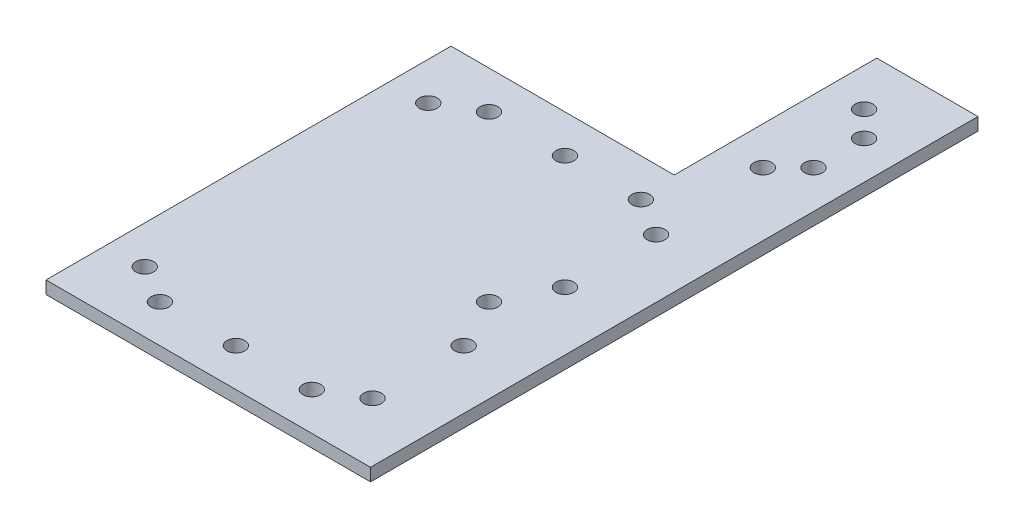
ISO-10303-21;
HEADER;
FILE_DESCRIPTION(('STEP AP214'),'2;1');
FILE_NAME('part.step','',(''),(''),'','','');
FILE_SCHEMA(('AUTOMOTIVE_DESIGN { 1 0 10303 214 1 1 1 1 }'));
ENDSEC;
DATA;
#1=APPLICATION_CONTEXT('core data for automotive mechanical design processes');
#2=APPLICATION_PROTOCOL_DEFINITION('international standard','automotive_design',2000,#1);
#3=PRODUCT_CONTEXT('',#1,'mechanical');
#4=PRODUCT('Part','Part','',(#3));
#5=PRODUCT_RELATED_PRODUCT_CATEGORY('part','',(#4));
#6=PRODUCT_DEFINITION_FORMATION('','',#4);
#7=PRODUCT_DEFINITION_CONTEXT('part definition',#1,'design');
#8=PRODUCT_DEFINITION('design','',#6,#7);
#9=PRODUCT_DEFINITION_SHAPE('','',#8);
#10=(LENGTH_UNIT() NAMED_UNIT(*) SI_UNIT(.MILLI.,.METRE.));
#11=(NAMED_UNIT(*) PLANE_ANGLE_UNIT() SI_UNIT($,.RADIAN.));
#12=(NAMED_UNIT(*) SI_UNIT($,.STERADIAN.) SOLID_ANGLE_UNIT());
#13=UNCERTAINTY_MEASURE_WITH_UNIT(LENGTH_MEASURE(1.E-05),#10,'distance_accuracy_value','');
#14=(GEOMETRIC_REPRESENTATION_CONTEXT(3) GLOBAL_UNCERTAINTY_ASSIGNED_CONTEXT((#13)) GLOBAL_UNIT_ASSIGNED_CONTEXT((#10,
#11,#12)) REPRESENTATION_CONTEXT('',''));
#15=CARTESIAN_POINT('',(0.,0.,0.));
#16=DIRECTION('',(0.,0.,1.));
#17=DIRECTION('',(1.,0.,0.));
#18=AXIS2_PLACEMENT_3D('',#15,#16,#17);
#19=CARTESIAN_POINT('',(0.,3.175,0.));
#20=DIRECTION('',(0.,-1.,0.));
#21=DIRECTION('',(0.,0.,-1.));
#22=AXIS2_PLACEMENT_3D('',#19,#20,#21);
#23=PLANE('',#22);
#24=CARTESIAN_POINT('',(27.425,3.175,-63.5));
#25=DIRECTION('',(0.,1.,0.));
#26=DIRECTION('',(0.,0.,1.));
#27=AXIS2_PLACEMENT_3D('',#24,#25,#26);
#28=CIRCLE('',#27,2.25);
#29=CARTESIAN_POINT('',(27.425,3.175,-61.25));
#30=VERTEX_POINT('',#29);
#31=EDGE_CURVE('E303',#30,#30,#28,.T.);
#32=ORIENTED_EDGE('',*,*,#31,.F.);
#33=EDGE_LOOP('',(#32));
#34=FACE_BOUND('',#33,.T.);
#35=CARTESIAN_POINT('',(27.425,3.175,-88.9));
#36=DIRECTION('',(0.,1.,0.));
#37=DIRECTION('',(0.,0.,1.));
#38=AXIS2_PLACEMENT_3D('',#35,#36,#37);
#39=CIRCLE('',#38,2.25);
#40=CARTESIAN_POINT('',(27.425,3.175,-86.65));
#41=VERTEX_POINT('',#40);
#42=EDGE_CURVE('E307',#41,#41,#39,.T.);
#43=ORIENTED_EDGE('',*,*,#42,.F.);
#44=EDGE_LOOP('',(#43));
#45=FACE_BOUND('',#44,.T.);
#46=CARTESIAN_POINT('',(33.77,3.175,-69.85));
#47=DIRECTION('',(0.,1.,0.));
#48=DIRECTION('',(0.,0.,1.));
#49=AXIS2_PLACEMENT_3D('',#46,#47,#48);
#50=CIRCLE('',#49,2.25);
#51=CARTESIAN_POINT('',(33.77,3.175,-67.6));
#52=VERTEX_POINT('',#51);
#53=EDGE_CURVE('E302',#52,#52,#50,.T.);
#54=ORIENTED_EDGE('',*,*,#53,.F.);
#55=EDGE_LOOP('',(#54));
#56=FACE_BOUND('',#55,.T.);
#57=CARTESIAN_POINT('',(33.77,3.175,-82.55));
#58=DIRECTION('',(0.,1.,0.));
#59=DIRECTION('',(0.,0.,1.));
#60=AXIS2_PLACEMENT_3D('',#57,#58,#59);
#61=CIRCLE('',#60,2.25);
#62=CARTESIAN_POINT('',(33.77,3.175,-80.3));
#63=VERTEX_POINT('',#62);
#64=EDGE_CURVE('E120',#63,#63,#61,.T.);
#65=ORIENTED_EDGE('',*,*,#64,.F.);
#66=EDGE_LOOP('',(#65));
#67=FACE_BOUND('',#66,.T.);
#68=DIRECTION('',(0.,0.,1.));
#69=VECTOR('',#68,1.);
#70=CARTESIAN_POINT('',(-38.1,3.175,-50.8));
#71=LINE('',#70,#69);
#72=CARTESIAN_POINT('',(-38.1,3.175,-50.8));
#73=VERTEX_POINT('',#72);
#74=CARTESIAN_POINT('',(-38.1,3.175,50.8));
#75=VERTEX_POINT('',#74);
#76=EDGE_CURVE('E90',#73,#75,#71,.T.);
#77=ORIENTED_EDGE('',*,*,#76,.T.);
#78=DIRECTION('',(1.,0.,0.));
#79=VECTOR('',#78,1.);
#80=CARTESIAN_POINT('',(38.1,3.175,50.8));
#81=LINE('',#80,#79);
#82=CARTESIAN_POINT('',(43.3,3.175,50.8));
#83=VERTEX_POINT('',#82);
#84=EDGE_CURVE('E270',#75,#83,#81,.T.);
#85=ORIENTED_EDGE('',*,*,#84,.T.);
#86=DIRECTION('',(0.,0.,-1.));
#87=VECTOR('',#86,1.);
#88=CARTESIAN_POINT('',(43.3,3.175,50.8));
#89=LINE('',#88,#87);
#90=CARTESIAN_POINT('',(43.3,3.175,-101.6));
#91=VERTEX_POINT('',#90);
#92=EDGE_CURVE('E130',#83,#91,#89,.T.);
#93=ORIENTED_EDGE('',*,*,#92,.T.);
#94=DIRECTION('',(-1.,0.,0.));
#95=VECTOR('',#94,1.);
#96=CARTESIAN_POINT('',(43.3,3.175,-101.6));
#97=LINE('',#96,#95);
#98=CARTESIAN_POINT('',(17.9,3.175,-101.6));
#99=VERTEX_POINT('',#98);
#100=EDGE_CURVE('E135',#91,#99,#97,.T.);
#101=ORIENTED_EDGE('',*,*,#100,.T.);
#102=DIRECTION('',(0.,0.,1.));
#103=VECTOR('',#102,1.);
#104=CARTESIAN_POINT('',(17.9,3.175,-101.6));
#105=LINE('',#104,#103);
#106=CARTESIAN_POINT('',(17.9,3.175,-50.8));
#107=VERTEX_POINT('',#106);
#108=EDGE_CURVE('E142',#99,#107,#105,.T.);
#109=ORIENTED_EDGE('',*,*,#108,.T.);
#110=DIRECTION('',(-1.,0.,0.));
#111=VECTOR('',#110,1.);
#112=CARTESIAN_POINT('',(38.1,3.175,-50.8));
#113=LINE('',#112,#111);
#114=EDGE_CURVE('E69',#107,#73,#113,.T.);
#115=ORIENTED_EDGE('',*,*,#114,.T.);
#116=EDGE_LOOP('',(#77,#85,#93,#101,#109,#115));
#117=FACE_BOUND('',#116,.T.);
#118=CARTESIAN_POINT('',(-19.05,3.175,41.275));
#119=DIRECTION('',(0.,1.,0.));
#120=DIRECTION('',(0.,0.,1.));
#121=AXIS2_PLACEMENT_3D('',#118,#119,#120);
#122=CIRCLE('',#121,2.25);
#123=CARTESIAN_POINT('',(-19.05,3.175,43.525));
#124=VERTEX_POINT('',#123);
#125=EDGE_CURVE('E104',#124,#124,#122,.T.);
#126=ORIENTED_EDGE('',*,*,#125,.F.);
#127=EDGE_LOOP('',(#126));
#128=FACE_BOUND('',#127,.T.);
#129=CARTESIAN_POINT('',(19.05,3.175,41.275));
#130=DIRECTION('',(0.,1.,0.));
#131=DIRECTION('',(0.,0.,1.));
#132=AXIS2_PLACEMENT_3D('',#129,#130,#131);
#133=CIRCLE('',#132,2.25);
#134=CARTESIAN_POINT('',(19.05,3.175,43.525));
#135=VERTEX_POINT('',#134);
#136=EDGE_CURVE('E259',#135,#135,#133,.T.);
#137=ORIENTED_EDGE('',*,*,#136,.F.);
#138=EDGE_LOOP('',(#137));
#139=FACE_BOUND('',#138,.T.);
#140=CARTESIAN_POINT('',(28.575,3.175,35.56));
#141=DIRECTION('',(0.,1.,0.));
#142=DIRECTION('',(0.,0.,1.));
#143=AXIS2_PLACEMENT_3D('',#140,#141,#142);
#144=CIRCLE('',#143,2.25);
#145=CARTESIAN_POINT('',(28.575,3.175,37.81));
#146=VERTEX_POINT('',#145);
#147=EDGE_CURVE('E251',#146,#146,#144,.T.);
#148=ORIENTED_EDGE('',*,*,#147,.F.);
#149=EDGE_LOOP('',(#148));
#150=FACE_BOUND('',#149,.T.);
#151=CARTESIAN_POINT('',(-28.575,3.175,35.56));
#152=DIRECTION('',(0.,1.,0.));
#153=DIRECTION('',(0.,0.,1.));
#154=AXIS2_PLACEMENT_3D('',#151,#152,#153);
#155=CIRCLE('',#154,2.25);
#156=CARTESIAN_POINT('',(-28.575,3.175,37.81));
#157=VERTEX_POINT('',#156);
#158=EDGE_CURVE('E243',#157,#157,#155,.T.);
#159=ORIENTED_EDGE('',*,*,#158,.F.);
#160=EDGE_LOOP('',(#159));
#161=FACE_BOUND('',#160,.T.);
#162=CARTESIAN_POINT('',(28.575,3.175,-35.56));
#163=DIRECTION('',(0.,1.,0.));
#164=DIRECTION('',(0.,0.,-1.));
#165=AXIS2_PLACEMENT_3D('',#162,#163,#164);
#166=CIRCLE('',#165,2.25);
#167=CARTESIAN_POINT('',(28.575,3.175,-37.81));
#168=VERTEX_POINT('',#167);
#169=EDGE_CURVE('E235',#168,#168,#166,.T.);
#170=ORIENTED_EDGE('',*,*,#169,.F.);
#171=EDGE_LOOP('',(#170));
#172=FACE_BOUND('',#171,.T.);
#173=CARTESIAN_POINT('',(19.05,3.175,-41.275));
#174=DIRECTION('',(0.,1.,0.));
#175=DIRECTION('',(0.,0.,-1.));
#176=AXIS2_PLACEMENT_3D('',#173,#174,#175);
#177=CIRCLE('',#176,2.25);
#178=CARTESIAN_POINT('',(19.05,3.175,-43.525));
#179=VERTEX_POINT('',#178);
#180=EDGE_CURVE('E227',#179,#179,#177,.T.);
#181=ORIENTED_EDGE('',*,*,#180,.F.);
#182=EDGE_LOOP('',(#181));
#183=FACE_BOUND('',#182,.T.);
#184=CARTESIAN_POINT('',(-28.575,3.175,-35.56));
#185=DIRECTION('',(0.,1.,0.));
#186=DIRECTION('',(0.,0.,-1.));
#187=AXIS2_PLACEMENT_3D('',#184,#185,#186);
#188=CIRCLE('',#187,2.25);
#189=CARTESIAN_POINT('',(-28.575,3.175,-37.81));
#190=VERTEX_POINT('',#189);
#191=EDGE_CURVE('E219',#190,#190,#188,.T.);
#192=ORIENTED_EDGE('',*,*,#191,.F.);
#193=EDGE_LOOP('',(#192));
#194=FACE_BOUND('',#193,.T.);
#195=CARTESIAN_POINT('',(-19.05,3.175,-41.275));
#196=DIRECTION('',(0.,1.,0.));
#197=DIRECTION('',(0.,0.,-1.));
#198=AXIS2_PLACEMENT_3D('',#195,#196,#197);
#199=CIRCLE('',#198,2.25);
#200=CARTESIAN_POINT('',(-19.05,3.175,-43.525));
#201=VERTEX_POINT('',#200);
#202=EDGE_CURVE('E211',#201,#201,#199,.T.);
#203=ORIENTED_EDGE('',*,*,#202,.F.);
#204=EDGE_LOOP('',(#203));
#205=FACE_BOUND('',#204,.T.);
#206=CARTESIAN_POINT('',(0.,3.175,41.275));
#207=DIRECTION('',(0.,1.,0.));
#208=DIRECTION('',(0.,0.,1.));
#209=AXIS2_PLACEMENT_3D('',#206,#207,#208);
#210=CIRCLE('',#209,2.25);
#211=CARTESIAN_POINT('',(0.,3.175,43.525));
#212=VERTEX_POINT('',#211);
#213=EDGE_CURVE('E203',#212,#212,#210,.T.);
#214=ORIENTED_EDGE('',*,*,#213,.F.);
#215=EDGE_LOOP('',(#214));
#216=FACE_BOUND('',#215,.T.);
#217=CARTESIAN_POINT('',(0.,3.175,-41.275));
#218=DIRECTION('',(0.,1.,0.));
#219=DIRECTION('',(0.,0.,-1.));
#220=AXIS2_PLACEMENT_3D('',#217,#218,#219);
#221=CIRCLE('',#220,2.25);
#222=CARTESIAN_POINT('',(0.,3.175,-43.525));
#223=VERTEX_POINT('',#222);
#224=EDGE_CURVE('E195',#223,#223,#221,.T.);
#225=ORIENTED_EDGE('',*,*,#224,.F.);
#226=EDGE_LOOP('',(#225));
#227=FACE_BOUND('',#226,.T.);
#228=CARTESIAN_POINT('',(28.575,3.175,-12.7));
#229=DIRECTION('',(0.,1.,0.));
#230=DIRECTION('',(0.,0.,1.));
#231=AXIS2_PLACEMENT_3D('',#228,#229,#230);
#232=CIRCLE('',#231,2.25);
#233=CARTESIAN_POINT('',(28.575,3.175,-10.45));
#234=VERTEX_POINT('',#233);
#235=EDGE_CURVE('E187',#234,#234,#232,.T.);
#236=ORIENTED_EDGE('',*,*,#235,.F.);
#237=EDGE_LOOP('',(#236));
#238=FACE_BOUND('',#237,.T.);
#239=CARTESIAN_POINT('',(28.575,3.175,12.7));
#240=DIRECTION('',(0.,1.,0.));
#241=DIRECTION('',(0.,0.,1.));
#242=AXIS2_PLACEMENT_3D('',#239,#240,#241);
#243=CIRCLE('',#242,2.25);
#244=CARTESIAN_POINT('',(28.575,3.175,14.95));
#245=VERTEX_POINT('',#244);
#246=EDGE_CURVE('E179',#245,#245,#243,.T.);
#247=ORIENTED_EDGE('',*,*,#246,.F.);
#248=EDGE_LOOP('',(#247));
#249=FACE_BOUND('',#248,.T.);
#250=CARTESIAN_POINT('',(22.23,3.175,0.));
#251=DIRECTION('',(0.,1.,0.));
#252=DIRECTION('',(0.,0.,1.));
#253=AXIS2_PLACEMENT_3D('',#250,#251,#252);
#254=CIRCLE('',#253,2.24999999999998);
#255=CARTESIAN_POINT('',(22.23,3.175,2.25));
#256=VERTEX_POINT('',#255);
#257=EDGE_CURVE('E171',#256,#256,#254,.T.);
#258=ORIENTED_EDGE('',*,*,#257,.F.);
#259=EDGE_LOOP('',(#258));
#260=FACE_BOUND('',#259,.T.);
#261=ADVANCED_FACE('F42',(#34,#45,#56,#67,#117,#128,#139,#150,#161,#172,#183,#194,#205,#216,
#227,#238,#249,#260),#23,.F.);
#262=CARTESIAN_POINT('',(0.,0.,0.));
#263=DIRECTION('',(0.,-1.,0.));
#264=DIRECTION('',(0.,0.,-1.));
#265=AXIS2_PLACEMENT_3D('',#262,#263,#264);
#266=PLANE('',#265);
#267=CARTESIAN_POINT('',(27.425,0.,-63.5));
#268=DIRECTION('',(0.,-1.,0.));
#269=DIRECTION('',(0.,0.,-1.));
#270=AXIS2_PLACEMENT_3D('',#267,#268,#269);
#271=CIRCLE('',#270,2.25);
#272=CARTESIAN_POINT('',(27.425,0.,-65.75));
#273=VERTEX_POINT('',#272);
#274=EDGE_CURVE('E46',#273,#273,#271,.T.);
#275=ORIENTED_EDGE('',*,*,#274,.F.);
#276=EDGE_LOOP('',(#275));
#277=FACE_BOUND('',#276,.T.);
#278=CARTESIAN_POINT('',(27.425,0.,-88.9));
#279=DIRECTION('',(0.,-1.,0.));
#280=DIRECTION('',(0.,0.,-1.));
#281=AXIS2_PLACEMENT_3D('',#278,#279,#280);
#282=CIRCLE('',#281,2.25);
#283=CARTESIAN_POINT('',(27.425,0.,-91.15));
#284=VERTEX_POINT('',#283);
#285=EDGE_CURVE('E123',#284,#284,#282,.T.);
#286=ORIENTED_EDGE('',*,*,#285,.F.);
#287=EDGE_LOOP('',(#286));
#288=FACE_BOUND('',#287,.T.);
#289=CARTESIAN_POINT('',(33.77,0.,-69.85));
#290=DIRECTION('',(0.,-1.,0.));
#291=DIRECTION('',(0.,0.,-1.));
#292=AXIS2_PLACEMENT_3D('',#289,#290,#291);
#293=CIRCLE('',#292,2.25);
#294=CARTESIAN_POINT('',(33.77,0.,-72.1));
#295=VERTEX_POINT('',#294);
#296=EDGE_CURVE('E119',#295,#295,#293,.T.);
#297=ORIENTED_EDGE('',*,*,#296,.F.);
#298=EDGE_LOOP('',(#297));
#299=FACE_BOUND('',#298,.T.);
#300=CARTESIAN_POINT('',(33.77,0.,-82.55));
#301=DIRECTION('',(0.,-1.,0.));
#302=DIRECTION('',(0.,0.,-1.));
#303=AXIS2_PLACEMENT_3D('',#300,#301,#302);
#304=CIRCLE('',#303,2.25);
#305=CARTESIAN_POINT('',(33.77,0.,-84.8));
#306=VERTEX_POINT('',#305);
#307=EDGE_CURVE('E115',#306,#306,#304,.T.);
#308=ORIENTED_EDGE('',*,*,#307,.F.);
#309=EDGE_LOOP('',(#308));
#310=FACE_BOUND('',#309,.T.);
#311=CARTESIAN_POINT('',(28.575,0.,12.7));
#312=DIRECTION('',(0.,1.,0.));
#313=DIRECTION('',(0.,0.,1.));
#314=AXIS2_PLACEMENT_3D('',#311,#312,#313);
#315=CIRCLE('',#314,2.25);
#316=CARTESIAN_POINT('',(28.575,0.,14.95));
#317=VERTEX_POINT('',#316);
#318=EDGE_CURVE('E175',#317,#317,#315,.T.);
#319=ORIENTED_EDGE('',*,*,#318,.T.);
#320=EDGE_LOOP('',(#319));
#321=FACE_BOUND('',#320,.T.);
#322=CARTESIAN_POINT('',(0.,0.,-41.275));
#323=DIRECTION('',(0.,1.,0.));
#324=DIRECTION('',(0.,0.,-1.));
#325=AXIS2_PLACEMENT_3D('',#322,#323,#324);
#326=CIRCLE('',#325,2.25);
#327=CARTESIAN_POINT('',(0.,0.,-43.525));
#328=VERTEX_POINT('',#327);
#329=EDGE_CURVE('E191',#328,#328,#326,.T.);
#330=ORIENTED_EDGE('',*,*,#329,.T.);
#331=EDGE_LOOP('',(#330));
#332=FACE_BOUND('',#331,.T.);
#333=CARTESIAN_POINT('',(-19.05,0.,-41.275));
#334=DIRECTION('',(0.,1.,0.));
#335=DIRECTION('',(0.,0.,-1.));
#336=AXIS2_PLACEMENT_3D('',#333,#334,#335);
#337=CIRCLE('',#336,2.25);
#338=CARTESIAN_POINT('',(-19.05,0.,-43.525));
#339=VERTEX_POINT('',#338);
#340=EDGE_CURVE('E207',#339,#339,#337,.T.);
#341=ORIENTED_EDGE('',*,*,#340,.T.);
#342=EDGE_LOOP('',(#341));
#343=FACE_BOUND('',#342,.T.);
#344=CARTESIAN_POINT('',(19.05,0.,-41.275));
#345=DIRECTION('',(0.,1.,0.));
#346=DIRECTION('',(0.,0.,-1.));
#347=AXIS2_PLACEMENT_3D('',#344,#345,#346);
#348=CIRCLE('',#347,2.25);
#349=CARTESIAN_POINT('',(19.05,0.,-43.525));
#350=VERTEX_POINT('',#349);
#351=EDGE_CURVE('E223',#350,#350,#348,.T.);
#352=ORIENTED_EDGE('',*,*,#351,.T.);
#353=EDGE_LOOP('',(#352));
#354=FACE_BOUND('',#353,.T.);
#355=CARTESIAN_POINT('',(-28.575,0.,35.56));
#356=DIRECTION('',(0.,1.,0.));
#357=DIRECTION('',(0.,0.,1.));
#358=AXIS2_PLACEMENT_3D('',#355,#356,#357);
#359=CIRCLE('',#358,2.25);
#360=CARTESIAN_POINT('',(-28.575,0.,37.81));
#361=VERTEX_POINT('',#360);
#362=EDGE_CURVE('E239',#361,#361,#359,.T.);
#363=ORIENTED_EDGE('',*,*,#362,.T.);
#364=EDGE_LOOP('',(#363));
#365=FACE_BOUND('',#364,.T.);
#366=CARTESIAN_POINT('',(19.05,0.,41.275));
#367=DIRECTION('',(0.,1.,0.));
#368=DIRECTION('',(0.,0.,1.));
#369=AXIS2_PLACEMENT_3D('',#366,#367,#368);
#370=CIRCLE('',#369,2.25);
#371=CARTESIAN_POINT('',(19.05,0.,43.525));
#372=VERTEX_POINT('',#371);
#373=EDGE_CURVE('E255',#372,#372,#370,.T.);
#374=ORIENTED_EDGE('',*,*,#373,.T.);
#375=EDGE_LOOP('',(#374));
#376=FACE_BOUND('',#375,.T.);
#377=DIRECTION('',(0.,0.,1.));
#378=VECTOR('',#377,1.);
#379=CARTESIAN_POINT('',(-38.1,0.,-50.8));
#380=LINE('',#379,#378);
#381=CARTESIAN_POINT('',(-38.1,0.,-50.8));
#382=VERTEX_POINT('',#381);
#383=CARTESIAN_POINT('',(-38.1,0.,50.8));
#384=VERTEX_POINT('',#383);
#385=EDGE_CURVE('E96',#382,#384,#380,.T.);
#386=ORIENTED_EDGE('',*,*,#385,.F.);
#387=DIRECTION('',(-1.,0.,0.));
#388=VECTOR('',#387,1.);
#389=CARTESIAN_POINT('',(38.1,0.,-50.8));
#390=LINE('',#389,#388);
#391=CARTESIAN_POINT('',(17.9,0.,-50.8));
#392=VERTEX_POINT('',#391);
#393=EDGE_CURVE('E82',#392,#382,#390,.T.);
#394=ORIENTED_EDGE('',*,*,#393,.F.);
#395=DIRECTION('',(0.,0.,1.));
#396=VECTOR('',#395,1.);
#397=CARTESIAN_POINT('',(17.9,0.,-101.6));
#398=LINE('',#397,#396);
#399=CARTESIAN_POINT('',(17.9,0.,-101.6));
#400=VERTEX_POINT('',#399);
#401=EDGE_CURVE('E60',#400,#392,#398,.T.);
#402=ORIENTED_EDGE('',*,*,#401,.F.);
#403=DIRECTION('',(-1.,0.,0.));
#404=VECTOR('',#403,1.);
#405=CARTESIAN_POINT('',(43.3,0.,-101.6));
#406=LINE('',#405,#404);
#407=CARTESIAN_POINT('',(43.3,0.,-101.6));
#408=VERTEX_POINT('',#407);
#409=EDGE_CURVE('E149',#408,#400,#406,.T.);
#410=ORIENTED_EDGE('',*,*,#409,.F.);
#411=DIRECTION('',(0.,0.,-1.));
#412=VECTOR('',#411,1.);
#413=CARTESIAN_POINT('',(43.3,0.,50.8));
#414=LINE('',#413,#412);
#415=CARTESIAN_POINT('',(43.3,0.,50.8));
#416=VERTEX_POINT('',#415);
#417=EDGE_CURVE('E154',#416,#408,#414,.T.);
#418=ORIENTED_EDGE('',*,*,#417,.F.);
#419=DIRECTION('',(1.,0.,0.));
#420=VECTOR('',#419,1.);
#421=CARTESIAN_POINT('',(38.1,0.,50.8));
#422=LINE('',#421,#420);
#423=EDGE_CURVE('E91',#384,#416,#422,.T.);
#424=ORIENTED_EDGE('',*,*,#423,.F.);
#425=EDGE_LOOP('',(#386,#394,#402,#410,#418,#424));
#426=FACE_BOUND('',#425,.T.);
#427=CARTESIAN_POINT('',(-19.05,0.,41.275));
#428=DIRECTION('',(0.,1.,0.));
#429=DIRECTION('',(0.,0.,1.));
#430=AXIS2_PLACEMENT_3D('',#427,#428,#429);
#431=CIRCLE('',#430,2.25);
#432=CARTESIAN_POINT('',(-19.05,0.,43.525));
#433=VERTEX_POINT('',#432);
#434=EDGE_CURVE('E110',#433,#433,#431,.T.);
#435=ORIENTED_EDGE('',*,*,#434,.T.);
#436=EDGE_LOOP('',(#435));
#437=FACE_BOUND('',#436,.T.);
#438=CARTESIAN_POINT('',(28.575,0.,35.56));
#439=DIRECTION('',(0.,1.,0.));
#440=DIRECTION('',(0.,0.,1.));
#441=AXIS2_PLACEMENT_3D('',#438,#439,#440);
#442=CIRCLE('',#441,2.25);
#443=CARTESIAN_POINT('',(28.575,0.,37.81));
#444=VERTEX_POINT('',#443);
#445=EDGE_CURVE('E247',#444,#444,#442,.T.);
#446=ORIENTED_EDGE('',*,*,#445,.T.);
#447=EDGE_LOOP('',(#446));
#448=FACE_BOUND('',#447,.T.);
#449=CARTESIAN_POINT('',(28.575,0.,-35.56));
#450=DIRECTION('',(0.,1.,0.));
#451=DIRECTION('',(0.,0.,-1.));
#452=AXIS2_PLACEMENT_3D('',#449,#450,#451);
#453=CIRCLE('',#452,2.25);
#454=CARTESIAN_POINT('',(28.575,0.,-37.81));
#455=VERTEX_POINT('',#454);
#456=EDGE_CURVE('E231',#455,#455,#453,.T.);
#457=ORIENTED_EDGE('',*,*,#456,.T.);
#458=EDGE_LOOP('',(#457));
#459=FACE_BOUND('',#458,.T.);
#460=CARTESIAN_POINT('',(-28.575,0.,-35.56));
#461=DIRECTION('',(0.,1.,0.));
#462=DIRECTION('',(0.,0.,-1.));
#463=AXIS2_PLACEMENT_3D('',#460,#461,#462);
#464=CIRCLE('',#463,2.25);
#465=CARTESIAN_POINT('',(-28.575,0.,-37.81));
#466=VERTEX_POINT('',#465);
#467=EDGE_CURVE('E215',#466,#466,#464,.T.);
#468=ORIENTED_EDGE('',*,*,#467,.T.);
#469=EDGE_LOOP('',(#468));
#470=FACE_BOUND('',#469,.T.);
#471=CARTESIAN_POINT('',(0.,0.,41.275));
#472=DIRECTION('',(0.,1.,0.));
#473=DIRECTION('',(0.,0.,1.));
#474=AXIS2_PLACEMENT_3D('',#471,#472,#473);
#475=CIRCLE('',#474,2.25);
#476=CARTESIAN_POINT('',(0.,0.,43.525));
#477=VERTEX_POINT('',#476);
#478=EDGE_CURVE('E199',#477,#477,#475,.T.);
#479=ORIENTED_EDGE('',*,*,#478,.T.);
#480=EDGE_LOOP('',(#479));
#481=FACE_BOUND('',#480,.T.);
#482=CARTESIAN_POINT('',(28.575,0.,-12.7));
#483=DIRECTION('',(0.,1.,0.));
#484=DIRECTION('',(0.,0.,1.));
#485=AXIS2_PLACEMENT_3D('',#482,#483,#484);
#486=CIRCLE('',#485,2.25);
#487=CARTESIAN_POINT('',(28.575,0.,-10.45));
#488=VERTEX_POINT('',#487);
#489=EDGE_CURVE('E183',#488,#488,#486,.T.);
#490=ORIENTED_EDGE('',*,*,#489,.T.);
#491=EDGE_LOOP('',(#490));
#492=FACE_BOUND('',#491,.T.);
#493=CARTESIAN_POINT('',(22.23,0.,0.));
#494=DIRECTION('',(0.,1.,0.));
#495=DIRECTION('',(0.,0.,1.));
#496=AXIS2_PLACEMENT_3D('',#493,#494,#495);
#497=CIRCLE('',#496,2.24999999999998);
#498=CARTESIAN_POINT('',(22.23,0.,2.25));
#499=VERTEX_POINT('',#498);
#500=EDGE_CURVE('E161',#499,#499,#497,.T.);
#501=ORIENTED_EDGE('',*,*,#500,.T.);
#502=EDGE_LOOP('',(#501));
#503=FACE_BOUND('',#502,.T.);
#504=ADVANCED_FACE('F99',(#277,#288,#299,#310,#321,#332,#343,#354,#365,#376,#426,#437,#448,#459,
#470,#481,#492,#503),#266,.T.);
#505=CARTESIAN_POINT('',(-38.1,3.175,-50.8));
#506=DIRECTION('',(1.,0.,0.));
#507=DIRECTION('',(0.,0.,-1.));
#508=AXIS2_PLACEMENT_3D('',#505,#506,#507);
#509=PLANE('',#508);
#510=ORIENTED_EDGE('',*,*,#385,.T.);
#511=DIRECTION('',(0.,-1.,0.));
#512=VECTOR('',#511,1.);
#513=CARTESIAN_POINT('',(-38.1,3.175,50.8));
#514=LINE('',#513,#512);
#515=EDGE_CURVE('E11',#75,#384,#514,.T.);
#516=ORIENTED_EDGE('',*,*,#515,.F.);
#517=ORIENTED_EDGE('',*,*,#76,.F.);
#518=DIRECTION('',(0.,-1.,0.));
#519=VECTOR('',#518,1.);
#520=CARTESIAN_POINT('',(-38.1,3.175,-50.8));
#521=LINE('',#520,#519);
#522=EDGE_CURVE('E52',#73,#382,#521,.T.);
#523=ORIENTED_EDGE('',*,*,#522,.T.);
#524=EDGE_LOOP('',(#510,#516,#517,#523));
#525=FACE_BOUND('',#524,.T.);
#526=ADVANCED_FACE('F44',(#525),#509,.F.);
#527=CARTESIAN_POINT('',(38.1,3.175,50.8));
#528=DIRECTION('',(0.,0.,-1.));
#529=DIRECTION('',(-1.,0.,0.));
#530=AXIS2_PLACEMENT_3D('',#527,#528,#529);
#531=PLANE('',#530);
#532=ORIENTED_EDGE('',*,*,#423,.T.);
#533=DIRECTION('',(0.,1.,0.));
#534=VECTOR('',#533,1.);
#535=CARTESIAN_POINT('',(43.3,-154.502168269575,50.8));
#536=LINE('',#535,#534);
#537=EDGE_CURVE('E158',#416,#83,#536,.T.);
#538=ORIENTED_EDGE('',*,*,#537,.T.);
#539=ORIENTED_EDGE('',*,*,#84,.F.);
#540=ORIENTED_EDGE('',*,*,#515,.T.);
#541=EDGE_LOOP('',(#532,#538,#539,#540));
#542=FACE_BOUND('',#541,.T.);
#543=ADVANCED_FACE('F279',(#542),#531,.F.);
#544=CARTESIAN_POINT('',(38.1,3.175,-50.8));
#545=DIRECTION('',(0.,0.,1.));
#546=DIRECTION('',(1.,0.,0.));
#547=AXIS2_PLACEMENT_3D('',#544,#545,#546);
#548=PLANE('',#547);
#549=ORIENTED_EDGE('',*,*,#114,.F.);
#550=DIRECTION('',(0.,1.,0.));
#551=VECTOR('',#550,1.);
#552=CARTESIAN_POINT('',(17.9,-154.502168269575,-50.8));
#553=LINE('',#552,#551);
#554=EDGE_CURVE('E86',#392,#107,#553,.T.);
#555=ORIENTED_EDGE('',*,*,#554,.F.);
#556=ORIENTED_EDGE('',*,*,#393,.T.);
#557=ORIENTED_EDGE('',*,*,#522,.F.);
#558=EDGE_LOOP('',(#549,#555,#556,#557));
#559=FACE_BOUND('',#558,.T.);
#560=ADVANCED_FACE('F84',(#559),#548,.F.);
#561=CARTESIAN_POINT('',(-19.05,3.175,41.275));
#562=DIRECTION('',(0.,-1.,0.));
#563=DIRECTION('',(0.,0.,-1.));
#564=AXIS2_PLACEMENT_3D('',#561,#562,#563);
#565=CYLINDRICAL_SURFACE('',#564,2.25);
#566=ORIENTED_EDGE('',*,*,#125,.T.);
#567=EDGE_LOOP('',(#566));
#568=FACE_BOUND('',#567,.T.);
#569=ORIENTED_EDGE('',*,*,#434,.F.);
#570=EDGE_LOOP('',(#569));
#571=FACE_BOUND('',#570,.T.);
#572=ADVANCED_FACE('F390',(#568,#571),#565,.F.);
#573=CARTESIAN_POINT('',(19.05,3.175,41.275));
#574=DIRECTION('',(0.,-1.,0.));
#575=DIRECTION('',(0.,0.,-1.));
#576=AXIS2_PLACEMENT_3D('',#573,#574,#575);
#577=CYLINDRICAL_SURFACE('',#576,2.25);
#578=ORIENTED_EDGE('',*,*,#136,.T.);
#579=EDGE_LOOP('',(#578));
#580=FACE_BOUND('',#579,.T.);
#581=ORIENTED_EDGE('',*,*,#373,.F.);
#582=EDGE_LOOP('',(#581));
#583=FACE_BOUND('',#582,.T.);
#584=ADVANCED_FACE('F386',(#580,#583),#577,.F.);
#585=CARTESIAN_POINT('',(28.575,3.175,35.56));
#586=DIRECTION('',(0.,-1.,0.));
#587=DIRECTION('',(0.,0.,-1.));
#588=AXIS2_PLACEMENT_3D('',#585,#586,#587);
#589=CYLINDRICAL_SURFACE('',#588,2.25);
#590=ORIENTED_EDGE('',*,*,#147,.T.);
#591=EDGE_LOOP('',(#590));
#592=FACE_BOUND('',#591,.T.);
#593=ORIENTED_EDGE('',*,*,#445,.F.);
#594=EDGE_LOOP('',(#593));
#595=FACE_BOUND('',#594,.T.);
#596=ADVANCED_FACE('F382',(#592,#595),#589,.F.);
#597=CARTESIAN_POINT('',(-28.575,3.175,35.56));
#598=DIRECTION('',(0.,-1.,0.));
#599=DIRECTION('',(0.,0.,-1.));
#600=AXIS2_PLACEMENT_3D('',#597,#598,#599);
#601=CYLINDRICAL_SURFACE('',#600,2.25);
#602=ORIENTED_EDGE('',*,*,#158,.T.);
#603=EDGE_LOOP('',(#602));
#604=FACE_BOUND('',#603,.T.);
#605=ORIENTED_EDGE('',*,*,#362,.F.);
#606=EDGE_LOOP('',(#605));
#607=FACE_BOUND('',#606,.T.);
#608=ADVANCED_FACE('F378',(#604,#607),#601,.F.);
#609=CARTESIAN_POINT('',(28.575,3.175,-35.56));
#610=DIRECTION('',(0.,-1.,0.));
#611=DIRECTION('',(0.,0.,-1.));
#612=AXIS2_PLACEMENT_3D('',#609,#610,#611);
#613=CYLINDRICAL_SURFACE('',#612,2.25);
#614=ORIENTED_EDGE('',*,*,#169,.T.);
#615=EDGE_LOOP('',(#614));
#616=FACE_BOUND('',#615,.T.);
#617=ORIENTED_EDGE('',*,*,#456,.F.);
#618=EDGE_LOOP('',(#617));
#619=FACE_BOUND('',#618,.T.);
#620=ADVANCED_FACE('F374',(#616,#619),#613,.F.);
#621=CARTESIAN_POINT('',(19.05,3.175,-41.275));
#622=DIRECTION('',(0.,-1.,0.));
#623=DIRECTION('',(0.,0.,-1.));
#624=AXIS2_PLACEMENT_3D('',#621,#622,#623);
#625=CYLINDRICAL_SURFACE('',#624,2.25);
#626=ORIENTED_EDGE('',*,*,#180,.T.);
#627=EDGE_LOOP('',(#626));
#628=FACE_BOUND('',#627,.T.);
#629=ORIENTED_EDGE('',*,*,#351,.F.);
#630=EDGE_LOOP('',(#629));
#631=FACE_BOUND('',#630,.T.);
#632=ADVANCED_FACE('F370',(#628,#631),#625,.F.);
#633=CARTESIAN_POINT('',(-28.575,3.175,-35.56));
#634=DIRECTION('',(0.,-1.,0.));
#635=DIRECTION('',(0.,0.,-1.));
#636=AXIS2_PLACEMENT_3D('',#633,#634,#635);
#637=CYLINDRICAL_SURFACE('',#636,2.25);
#638=ORIENTED_EDGE('',*,*,#191,.T.);
#639=EDGE_LOOP('',(#638));
#640=FACE_BOUND('',#639,.T.);
#641=ORIENTED_EDGE('',*,*,#467,.F.);
#642=EDGE_LOOP('',(#641));
#643=FACE_BOUND('',#642,.T.);
#644=ADVANCED_FACE('F366',(#640,#643),#637,.F.);
#645=CARTESIAN_POINT('',(-19.05,3.175,-41.275));
#646=DIRECTION('',(0.,-1.,0.));
#647=DIRECTION('',(0.,0.,-1.));
#648=AXIS2_PLACEMENT_3D('',#645,#646,#647);
#649=CYLINDRICAL_SURFACE('',#648,2.25);
#650=ORIENTED_EDGE('',*,*,#202,.T.);
#651=EDGE_LOOP('',(#650));
#652=FACE_BOUND('',#651,.T.);
#653=ORIENTED_EDGE('',*,*,#340,.F.);
#654=EDGE_LOOP('',(#653));
#655=FACE_BOUND('',#654,.T.);
#656=ADVANCED_FACE('F362',(#652,#655),#649,.F.);
#657=CARTESIAN_POINT('',(0.,3.175,41.275));
#658=DIRECTION('',(0.,-1.,0.));
#659=DIRECTION('',(0.,0.,-1.));
#660=AXIS2_PLACEMENT_3D('',#657,#658,#659);
#661=CYLINDRICAL_SURFACE('',#660,2.25);
#662=ORIENTED_EDGE('',*,*,#213,.T.);
#663=EDGE_LOOP('',(#662));
#664=FACE_BOUND('',#663,.T.);
#665=ORIENTED_EDGE('',*,*,#478,.F.);
#666=EDGE_LOOP('',(#665));
#667=FACE_BOUND('',#666,.T.);
#668=ADVANCED_FACE('F358',(#664,#667),#661,.F.);
#669=CARTESIAN_POINT('',(0.,3.175,-41.275));
#670=DIRECTION('',(0.,-1.,0.));
#671=DIRECTION('',(0.,0.,-1.));
#672=AXIS2_PLACEMENT_3D('',#669,#670,#671);
#673=CYLINDRICAL_SURFACE('',#672,2.25);
#674=ORIENTED_EDGE('',*,*,#224,.T.);
#675=EDGE_LOOP('',(#674));
#676=FACE_BOUND('',#675,.T.);
#677=ORIENTED_EDGE('',*,*,#329,.F.);
#678=EDGE_LOOP('',(#677));
#679=FACE_BOUND('',#678,.T.);
#680=ADVANCED_FACE('F354',(#676,#679),#673,.F.);
#681=CARTESIAN_POINT('',(28.575,3.175,-12.7));
#682=DIRECTION('',(0.,-1.,0.));
#683=DIRECTION('',(0.,0.,-1.));
#684=AXIS2_PLACEMENT_3D('',#681,#682,#683);
#685=CYLINDRICAL_SURFACE('',#684,2.25);
#686=ORIENTED_EDGE('',*,*,#235,.T.);
#687=EDGE_LOOP('',(#686));
#688=FACE_BOUND('',#687,.T.);
#689=ORIENTED_EDGE('',*,*,#489,.F.);
#690=EDGE_LOOP('',(#689));
#691=FACE_BOUND('',#690,.T.);
#692=ADVANCED_FACE('F350',(#688,#691),#685,.F.);
#693=CARTESIAN_POINT('',(28.575,3.175,12.7));
#694=DIRECTION('',(0.,-1.,0.));
#695=DIRECTION('',(0.,0.,-1.));
#696=AXIS2_PLACEMENT_3D('',#693,#694,#695);
#697=CYLINDRICAL_SURFACE('',#696,2.25);
#698=ORIENTED_EDGE('',*,*,#246,.T.);
#699=EDGE_LOOP('',(#698));
#700=FACE_BOUND('',#699,.T.);
#701=ORIENTED_EDGE('',*,*,#318,.F.);
#702=EDGE_LOOP('',(#701));
#703=FACE_BOUND('',#702,.T.);
#704=ADVANCED_FACE('F346',(#700,#703),#697,.F.);
#705=CARTESIAN_POINT('',(22.23,3.175,0.));
#706=DIRECTION('',(0.,-1.,0.));
#707=DIRECTION('',(0.,0.,-1.));
#708=AXIS2_PLACEMENT_3D('',#705,#706,#707);
#709=CYLINDRICAL_SURFACE('',#708,2.24999999999998);
#710=ORIENTED_EDGE('',*,*,#257,.T.);
#711=EDGE_LOOP('',(#710));
#712=FACE_BOUND('',#711,.T.);
#713=ORIENTED_EDGE('',*,*,#500,.F.);
#714=EDGE_LOOP('',(#713));
#715=FACE_BOUND('',#714,.T.);
#716=ADVANCED_FACE('F343',(#712,#715),#709,.F.);
#717=CARTESIAN_POINT('',(43.3,-154.502168269575,50.8));
#718=DIRECTION('',(1.,0.,0.));
#719=DIRECTION('',(0.,0.,-1.));
#720=AXIS2_PLACEMENT_3D('',#717,#718,#719);
#721=PLANE('',#720);
#722=ORIENTED_EDGE('',*,*,#537,.F.);
#723=ORIENTED_EDGE('',*,*,#417,.T.);
#724=DIRECTION('',(0.,1.,0.));
#725=VECTOR('',#724,1.);
#726=CARTESIAN_POINT('',(43.3,-154.502168269575,-101.6));
#727=LINE('',#726,#725);
#728=EDGE_CURVE('E153',#408,#91,#727,.T.);
#729=ORIENTED_EDGE('',*,*,#728,.T.);
#730=ORIENTED_EDGE('',*,*,#92,.F.);
#731=EDGE_LOOP('',(#722,#723,#729,#730));
#732=FACE_BOUND('',#731,.T.);
#733=ADVANCED_FACE('F281',(#732),#721,.T.);
#734=CARTESIAN_POINT('',(43.3,-154.502168269575,-101.6));
#735=DIRECTION('',(0.,0.,-1.));
#736=DIRECTION('',(-1.,0.,0.));
#737=AXIS2_PLACEMENT_3D('',#734,#735,#736);
#738=PLANE('',#737);
#739=ORIENTED_EDGE('',*,*,#728,.F.);
#740=ORIENTED_EDGE('',*,*,#409,.T.);
#741=DIRECTION('',(0.,1.,0.));
#742=VECTOR('',#741,1.);
#743=CARTESIAN_POINT('',(17.9,-154.502168269575,-101.6));
#744=LINE('',#743,#742);
#745=EDGE_CURVE('E148',#400,#99,#744,.T.);
#746=ORIENTED_EDGE('',*,*,#745,.T.);
#747=ORIENTED_EDGE('',*,*,#100,.F.);
#748=EDGE_LOOP('',(#739,#740,#746,#747));
#749=FACE_BOUND('',#748,.T.);
#750=ADVANCED_FACE('F288',(#749),#738,.T.);
#751=CARTESIAN_POINT('',(17.9,-154.502168269575,-101.6));
#752=DIRECTION('',(-1.,0.,0.));
#753=DIRECTION('',(0.,0.,1.));
#754=AXIS2_PLACEMENT_3D('',#751,#752,#753);
#755=PLANE('',#754);
#756=ORIENTED_EDGE('',*,*,#745,.F.);
#757=ORIENTED_EDGE('',*,*,#401,.T.);
#758=ORIENTED_EDGE('',*,*,#554,.T.);
#759=ORIENTED_EDGE('',*,*,#108,.F.);
#760=EDGE_LOOP('',(#756,#757,#758,#759));
#761=FACE_BOUND('',#760,.T.);
#762=ADVANCED_FACE('F296',(#761),#755,.T.);
#763=CARTESIAN_POINT('',(33.77,-6.825,-82.55));
#764=DIRECTION('',(0.,1.,0.));
#765=DIRECTION('',(0.,0.,1.));
#766=AXIS2_PLACEMENT_3D('',#763,#764,#765);
#767=CYLINDRICAL_SURFACE('',#766,2.25);
#768=ORIENTED_EDGE('',*,*,#307,.T.);
#769=EDGE_LOOP('',(#768));
#770=FACE_BOUND('',#769,.T.);
#771=ORIENTED_EDGE('',*,*,#64,.T.);
#772=EDGE_LOOP('',(#771));
#773=FACE_BOUND('',#772,.T.);
#774=ADVANCED_FACE('F323',(#770,#773),#767,.F.);
#775=CARTESIAN_POINT('',(33.77,-6.825,-69.85));
#776=DIRECTION('',(0.,1.,0.));
#777=DIRECTION('',(0.,0.,1.));
#778=AXIS2_PLACEMENT_3D('',#775,#776,#777);
#779=CYLINDRICAL_SURFACE('',#778,2.25);
#780=ORIENTED_EDGE('',*,*,#296,.T.);
#781=EDGE_LOOP('',(#780));
#782=FACE_BOUND('',#781,.T.);
#783=ORIENTED_EDGE('',*,*,#53,.T.);
#784=EDGE_LOOP('',(#783));
#785=FACE_BOUND('',#784,.T.);
#786=ADVANCED_FACE('F315',(#782,#785),#779,.F.);
#787=CARTESIAN_POINT('',(27.425,-6.825,-88.9));
#788=DIRECTION('',(0.,1.,0.));
#789=DIRECTION('',(0.,0.,1.));
#790=AXIS2_PLACEMENT_3D('',#787,#788,#789);
#791=CYLINDRICAL_SURFACE('',#790,2.25);
#792=ORIENTED_EDGE('',*,*,#285,.T.);
#793=EDGE_LOOP('',(#792));
#794=FACE_BOUND('',#793,.T.);
#795=ORIENTED_EDGE('',*,*,#42,.T.);
#796=EDGE_LOOP('',(#795));
#797=FACE_BOUND('',#796,.T.);
#798=ADVANCED_FACE('F331',(#794,#797),#791,.F.);
#799=CARTESIAN_POINT('',(27.425,-6.825,-63.5));
#800=DIRECTION('',(0.,1.,0.));
#801=DIRECTION('',(0.,0.,1.));
#802=AXIS2_PLACEMENT_3D('',#799,#800,#801);
#803=CYLINDRICAL_SURFACE('',#802,2.25);
#804=ORIENTED_EDGE('',*,*,#274,.T.);
#805=EDGE_LOOP('',(#804));
#806=FACE_BOUND('',#805,.T.);
#807=ORIENTED_EDGE('',*,*,#31,.T.);
#808=EDGE_LOOP('',(#807));
#809=FACE_BOUND('',#808,.T.);
#810=ADVANCED_FACE('F336',(#806,#809),#803,.F.);
#811=CLOSED_SHELL('',(#261,#504,#526,#543,#560,#572,#584,#596,#608,#620,#632,#644,#656,#668,
#680,#692,#704,#716,#733,#750,#762,#774,#786,#798,#810));
#812=MANIFOLD_SOLID_BREP('B2',#811);
#813=ADVANCED_BREP_SHAPE_REPRESENTATION('',(#18,#812),#14);
#814=SHAPE_DEFINITION_REPRESENTATION(#9,#813);
ENDSEC;
END-ISO-10303-21;
